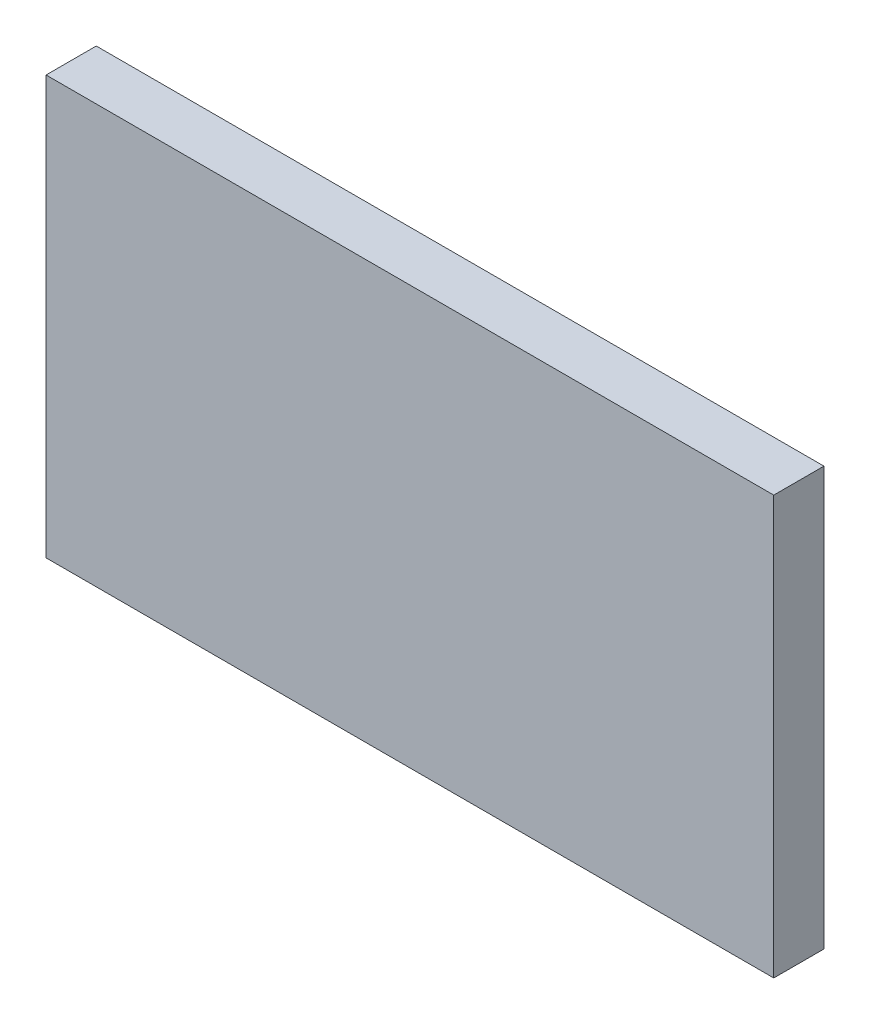
ISO-10303-21;
HEADER;
FILE_DESCRIPTION(('STEP AP214'),'2;1');
FILE_NAME('part.step','',(''),(''),'','','');
FILE_SCHEMA(('AUTOMOTIVE_DESIGN { 1 0 10303 214 1 1 1 1 }'));
ENDSEC;
DATA;
#1=APPLICATION_CONTEXT('core data for automotive mechanical design processes');
#2=APPLICATION_PROTOCOL_DEFINITION('international standard','automotive_design',2000,#1);
#3=PRODUCT_CONTEXT('',#1,'mechanical');
#4=PRODUCT('Part','Part','',(#3));
#5=PRODUCT_RELATED_PRODUCT_CATEGORY('part','',(#4));
#6=PRODUCT_DEFINITION_FORMATION('','',#4);
#7=PRODUCT_DEFINITION_CONTEXT('part definition',#1,'design');
#8=PRODUCT_DEFINITION('design','',#6,#7);
#9=PRODUCT_DEFINITION_SHAPE('','',#8);
#10=(LENGTH_UNIT() NAMED_UNIT(*) SI_UNIT(.MILLI.,.METRE.));
#11=(NAMED_UNIT(*) PLANE_ANGLE_UNIT() SI_UNIT($,.RADIAN.));
#12=(NAMED_UNIT(*) SI_UNIT($,.STERADIAN.) SOLID_ANGLE_UNIT());
#13=UNCERTAINTY_MEASURE_WITH_UNIT(LENGTH_MEASURE(1.E-05),#10,'distance_accuracy_value','');
#14=(GEOMETRIC_REPRESENTATION_CONTEXT(3) GLOBAL_UNCERTAINTY_ASSIGNED_CONTEXT((#13)) GLOBAL_UNIT_ASSIGNED_CONTEXT((#10,
#11,#12)) REPRESENTATION_CONTEXT('',''));
#15=CARTESIAN_POINT('',(0.,0.,0.));
#16=DIRECTION('',(0.,0.,1.));
#17=DIRECTION('',(1.,0.,0.));
#18=AXIS2_PLACEMENT_3D('',#15,#16,#17);
#19=CARTESIAN_POINT('',(174.,0.,12.));
#20=DIRECTION('',(0.,1.,0.));
#21=DIRECTION('',(-1.,0.,0.));
#22=AXIS2_PLACEMENT_3D('',#19,#20,#21);
#23=PLANE('',#22);
#24=DIRECTION('',(1.,0.,0.));
#25=VECTOR('',#24,1.);
#26=CARTESIAN_POINT('',(174.,0.,0.));
#27=LINE('',#26,#25);
#28=CARTESIAN_POINT('',(0.,0.,0.));
#29=VERTEX_POINT('',#28);
#30=CARTESIAN_POINT('',(174.,0.,0.));
#31=VERTEX_POINT('',#30);
#32=EDGE_CURVE('E107',#29,#31,#27,.T.);
#33=ORIENTED_EDGE('',*,*,#32,.T.);
#34=DIRECTION('',(0.,0.,-1.));
#35=VECTOR('',#34,1.);
#36=CARTESIAN_POINT('',(174.,0.,12.));
#37=LINE('',#36,#35);
#38=CARTESIAN_POINT('',(174.,0.,12.));
#39=VERTEX_POINT('',#38);
#40=EDGE_CURVE('E11',#39,#31,#37,.T.);
#41=ORIENTED_EDGE('',*,*,#40,.F.);
#42=DIRECTION('',(1.,0.,0.));
#43=VECTOR('',#42,1.);
#44=CARTESIAN_POINT('',(174.,0.,12.));
#45=LINE('',#44,#43);
#46=CARTESIAN_POINT('',(0.,0.,12.));
#47=VERTEX_POINT('',#46);
#48=EDGE_CURVE('E91',#47,#39,#45,.T.);
#49=ORIENTED_EDGE('',*,*,#48,.F.);
#50=DIRECTION('',(0.,0.,-1.));
#51=VECTOR('',#50,1.);
#52=CARTESIAN_POINT('',(0.,0.,12.));
#53=LINE('',#52,#51);
#54=EDGE_CURVE('E103',#47,#29,#53,.T.);
#55=ORIENTED_EDGE('',*,*,#54,.T.);
#56=EDGE_LOOP('',(#33,#41,#49,#55));
#57=FACE_BOUND('',#56,.T.);
#58=ADVANCED_FACE('F39',(#57),#23,.F.);
#59=CARTESIAN_POINT('',(174.,100.,12.));
#60=DIRECTION('',(-1.,0.,0.));
#61=DIRECTION('',(0.,0.,1.));
#62=AXIS2_PLACEMENT_3D('',#59,#60,#61);
#63=PLANE('',#62);
#64=DIRECTION('',(0.,1.,0.));
#65=VECTOR('',#64,1.);
#66=CARTESIAN_POINT('',(174.,100.,0.));
#67=LINE('',#66,#65);
#68=CARTESIAN_POINT('',(174.,100.,0.));
#69=VERTEX_POINT('',#68);
#70=EDGE_CURVE('E96',#31,#69,#67,.T.);
#71=ORIENTED_EDGE('',*,*,#70,.T.);
#72=DIRECTION('',(0.,0.,-1.));
#73=VECTOR('',#72,1.);
#74=CARTESIAN_POINT('',(174.,100.,12.));
#75=LINE('',#74,#73);
#76=CARTESIAN_POINT('',(174.,100.,12.));
#77=VERTEX_POINT('',#76);
#78=EDGE_CURVE('E48',#77,#69,#75,.T.);
#79=ORIENTED_EDGE('',*,*,#78,.F.);
#80=DIRECTION('',(0.,1.,0.));
#81=VECTOR('',#80,1.);
#82=CARTESIAN_POINT('',(174.,100.,12.));
#83=LINE('',#82,#81);
#84=EDGE_CURVE('E86',#39,#77,#83,.T.);
#85=ORIENTED_EDGE('',*,*,#84,.F.);
#86=ORIENTED_EDGE('',*,*,#40,.T.);
#87=EDGE_LOOP('',(#71,#79,#85,#86));
#88=FACE_BOUND('',#87,.T.);
#89=ADVANCED_FACE('F95',(#88),#63,.F.);
#90=CARTESIAN_POINT('',(0.,100.,12.));
#91=DIRECTION('',(0.,-1.,0.));
#92=DIRECTION('',(0.,0.,-1.));
#93=AXIS2_PLACEMENT_3D('',#90,#91,#92);
#94=PLANE('',#93);
#95=DIRECTION('',(-1.,0.,0.));
#96=VECTOR('',#95,1.);
#97=CARTESIAN_POINT('',(0.,100.,0.));
#98=LINE('',#97,#96);
#99=CARTESIAN_POINT('',(0.,100.,0.));
#100=VERTEX_POINT('',#99);
#101=EDGE_CURVE('E73',#69,#100,#98,.T.);
#102=ORIENTED_EDGE('',*,*,#101,.T.);
#103=DIRECTION('',(0.,0.,-1.));
#104=VECTOR('',#103,1.);
#105=CARTESIAN_POINT('',(0.,100.,12.));
#106=LINE('',#105,#104);
#107=CARTESIAN_POINT('',(0.,100.,12.));
#108=VERTEX_POINT('',#107);
#109=EDGE_CURVE('E98',#108,#100,#106,.T.);
#110=ORIENTED_EDGE('',*,*,#109,.F.);
#111=DIRECTION('',(-1.,0.,0.));
#112=VECTOR('',#111,1.);
#113=CARTESIAN_POINT('',(0.,100.,12.));
#114=LINE('',#113,#112);
#115=EDGE_CURVE('E89',#77,#108,#114,.T.);
#116=ORIENTED_EDGE('',*,*,#115,.F.);
#117=ORIENTED_EDGE('',*,*,#78,.T.);
#118=EDGE_LOOP('',(#102,#110,#116,#117));
#119=FACE_BOUND('',#118,.T.);
#120=ADVANCED_FACE('F99',(#119),#94,.F.);
#121=CARTESIAN_POINT('',(0.,0.,12.));
#122=DIRECTION('',(1.,0.,0.));
#123=DIRECTION('',(0.,0.,-1.));
#124=AXIS2_PLACEMENT_3D('',#121,#122,#123);
#125=PLANE('',#124);
#126=DIRECTION('',(0.,-1.,0.));
#127=VECTOR('',#126,1.);
#128=CARTESIAN_POINT('',(0.,0.,0.));
#129=LINE('',#128,#127);
#130=EDGE_CURVE('E79',#100,#29,#129,.T.);
#131=ORIENTED_EDGE('',*,*,#130,.T.);
#132=ORIENTED_EDGE('',*,*,#54,.F.);
#133=DIRECTION('',(0.,-1.,0.));
#134=VECTOR('',#133,1.);
#135=CARTESIAN_POINT('',(0.,0.,12.));
#136=LINE('',#135,#134);
#137=EDGE_CURVE('E56',#108,#47,#136,.T.);
#138=ORIENTED_EDGE('',*,*,#137,.F.);
#139=ORIENTED_EDGE('',*,*,#109,.T.);
#140=EDGE_LOOP('',(#131,#132,#138,#139));
#141=FACE_BOUND('',#140,.T.);
#142=ADVANCED_FACE('F120',(#141),#125,.F.);
#143=CARTESIAN_POINT('',(0.,0.,12.));
#144=DIRECTION('',(0.,0.,-1.));
#145=DIRECTION('',(-1.,0.,0.));
#146=AXIS2_PLACEMENT_3D('',#143,#144,#145);
#147=PLANE('',#146);
#148=ORIENTED_EDGE('',*,*,#48,.T.);
#149=ORIENTED_EDGE('',*,*,#84,.T.);
#150=ORIENTED_EDGE('',*,*,#115,.T.);
#151=ORIENTED_EDGE('',*,*,#137,.T.);
#152=EDGE_LOOP('',(#148,#149,#150,#151));
#153=FACE_BOUND('',#152,.T.);
#154=ADVANCED_FACE('F87',(#153),#147,.F.);
#155=CARTESIAN_POINT('',(0.,0.,0.));
#156=DIRECTION('',(0.,0.,-1.));
#157=DIRECTION('',(-1.,0.,0.));
#158=AXIS2_PLACEMENT_3D('',#155,#156,#157);
#159=PLANE('',#158);
#160=ORIENTED_EDGE('',*,*,#32,.F.);
#161=ORIENTED_EDGE('',*,*,#130,.F.);
#162=ORIENTED_EDGE('',*,*,#101,.F.);
#163=ORIENTED_EDGE('',*,*,#70,.F.);
#164=EDGE_LOOP('',(#160,#161,#162,#163));
#165=FACE_BOUND('',#164,.T.);
#166=ADVANCED_FACE('F123',(#165),#159,.T.);
#167=CLOSED_SHELL('',(#58,#89,#120,#142,#154,#166));
#168=MANIFOLD_SOLID_BREP('B2',#167);
#169=ADVANCED_BREP_SHAPE_REPRESENTATION('',(#18,#168),#14);
#170=SHAPE_DEFINITION_REPRESENTATION(#9,#169);
ENDSEC;
END-ISO-10303-21;
